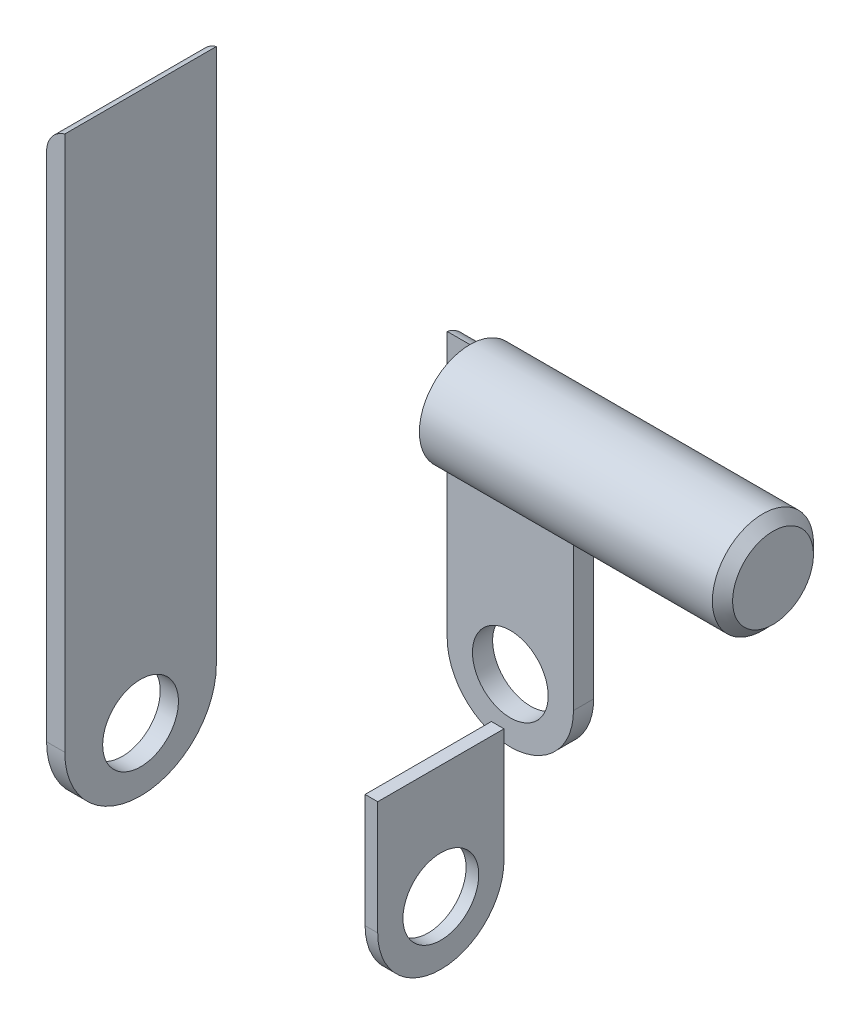
ISO-10303-21;
HEADER;
FILE_DESCRIPTION(('STEP AP214'),'2;1');
FILE_NAME('part.step','',(''),(''),'','','');
FILE_SCHEMA(('AUTOMOTIVE_DESIGN { 1 0 10303 214 1 1 1 1 }'));
ENDSEC;
DATA;
#1=APPLICATION_CONTEXT('core data for automotive mechanical design processes');
#2=APPLICATION_PROTOCOL_DEFINITION('international standard','automotive_design',2000,#1);
#3=PRODUCT_CONTEXT('',#1,'mechanical');
#4=PRODUCT('Part','Part','',(#3));
#5=PRODUCT_RELATED_PRODUCT_CATEGORY('part','',(#4));
#6=PRODUCT_DEFINITION_FORMATION('','',#4);
#7=PRODUCT_DEFINITION_CONTEXT('part definition',#1,'design');
#8=PRODUCT_DEFINITION('design','',#6,#7);
#9=PRODUCT_DEFINITION_SHAPE('','',#8);
#10=(LENGTH_UNIT() NAMED_UNIT(*) SI_UNIT(.MILLI.,.METRE.));
#11=(NAMED_UNIT(*) PLANE_ANGLE_UNIT() SI_UNIT($,.RADIAN.));
#12=(NAMED_UNIT(*) SI_UNIT($,.STERADIAN.) SOLID_ANGLE_UNIT());
#13=UNCERTAINTY_MEASURE_WITH_UNIT(LENGTH_MEASURE(1.E-05),#10,'distance_accuracy_value','');
#14=(GEOMETRIC_REPRESENTATION_CONTEXT(3) GLOBAL_UNCERTAINTY_ASSIGNED_CONTEXT((#13)) GLOBAL_UNIT_ASSIGNED_CONTEXT((#10,
#11,#12)) REPRESENTATION_CONTEXT('',''));
#15=CARTESIAN_POINT('',(0.,0.,0.));
#16=DIRECTION('',(0.,0.,1.));
#17=DIRECTION('',(1.,0.,0.));
#18=AXIS2_PLACEMENT_3D('',#15,#16,#17);
#19=CARTESIAN_POINT('',(-7.825,-7.625,1.25));
#20=DIRECTION('',(-1.,0.,0.));
#21=DIRECTION('',(0.,0.,1.));
#22=AXIS2_PLACEMENT_3D('',#19,#20,#21);
#23=PLANE('',#22);
#24=CARTESIAN_POINT('',(-7.825,-8.75,0.));
#25=DIRECTION('',(-1.,0.,0.));
#26=DIRECTION('',(0.,0.,1.));
#27=AXIS2_PLACEMENT_3D('',#24,#25,#26);
#28=CIRCLE('',#27,0.75);
#29=CARTESIAN_POINT('',(-7.825,-8.75,0.75));
#30=VERTEX_POINT('',#29);
#31=EDGE_CURVE('P0_E19',#30,#30,#28,.F.);
#32=ORIENTED_EDGE('',*,*,#31,.T.);
#33=EDGE_LOOP('',(#32));
#34=FACE_BOUND('',#33,.T.);
#35=CARTESIAN_POINT('',(-7.825,-8.75,0.));
#36=DIRECTION('',(-1.,0.,0.));
#37=DIRECTION('',(0.,0.,1.));
#38=AXIS2_PLACEMENT_3D('',#35,#36,#37);
#39=CIRCLE('',#38,1.25);
#40=CARTESIAN_POINT('',(-7.825,-8.75,1.25));
#41=VERTEX_POINT('',#40);
#42=CARTESIAN_POINT('',(-7.825,-8.75,-1.25));
#43=VERTEX_POINT('',#42);
#44=EDGE_CURVE('P0_E47',#41,#43,#39,.F.);
#45=ORIENTED_EDGE('',*,*,#44,.F.);
#46=DIRECTION('',(0.,1.,0.));
#47=VECTOR('',#46,1.);
#48=CARTESIAN_POINT('',(-7.825,-10.,1.25));
#49=LINE('',#48,#47);
#50=CARTESIAN_POINT('',(-7.825,-6.5,1.25));
#51=VERTEX_POINT('',#50);
#52=EDGE_CURVE('P0_E51',#41,#51,#49,.T.);
#53=ORIENTED_EDGE('',*,*,#52,.T.);
#54=DIRECTION('',(0.,0.,1.));
#55=VECTOR('',#54,1.);
#56=CARTESIAN_POINT('',(-7.825,-6.5,1.25));
#57=LINE('',#56,#55);
#58=CARTESIAN_POINT('',(-7.825,-6.5,-1.25));
#59=VERTEX_POINT('',#58);
#60=EDGE_CURVE('P0_E65',#59,#51,#57,.T.);
#61=ORIENTED_EDGE('',*,*,#60,.F.);
#62=DIRECTION('',(0.,1.,0.));
#63=VECTOR('',#62,1.);
#64=CARTESIAN_POINT('',(-7.825,-10.,-1.25));
#65=LINE('',#64,#63);
#66=EDGE_CURVE('P0_E64',#59,#43,#65,.F.);
#67=ORIENTED_EDGE('',*,*,#66,.T.);
#68=EDGE_LOOP('',(#45,#53,#61,#67));
#69=FACE_BOUND('',#68,.T.);
#70=ADVANCED_FACE('P0_F16',(#34,#69),#23,.T.);
#71=CARTESIAN_POINT('',(-7.825,-8.75,0.));
#72=DIRECTION('',(-1.,0.,0.));
#73=DIRECTION('',(0.,0.,1.));
#74=AXIS2_PLACEMENT_3D('',#71,#72,#73);
#75=CYLINDRICAL_SURFACE('',#74,0.75);
#76=ORIENTED_EDGE('',*,*,#31,.F.);
#77=EDGE_LOOP('',(#76));
#78=FACE_BOUND('',#77,.T.);
#79=CARTESIAN_POINT('',(-7.575,-8.75,0.));
#80=DIRECTION('',(-1.,0.,0.));
#81=DIRECTION('',(0.,0.,1.));
#82=AXIS2_PLACEMENT_3D('',#79,#80,#81);
#83=CIRCLE('',#82,0.75);
#84=CARTESIAN_POINT('',(-7.575,-8.75,0.75));
#85=VERTEX_POINT('',#84);
#86=EDGE_CURVE('P0_E75',#85,#85,#83,.T.);
#87=ORIENTED_EDGE('',*,*,#86,.F.);
#88=EDGE_LOOP('',(#87));
#89=FACE_BOUND('',#88,.T.);
#90=ADVANCED_FACE('P0_F114',(#78,#89),#75,.F.);
#91=CARTESIAN_POINT('',(-7.7,-6.5,1.25));
#92=DIRECTION('',(0.,1.,0.));
#93=DIRECTION('',(0.,0.,1.));
#94=AXIS2_PLACEMENT_3D('',#91,#92,#93);
#95=PLANE('',#94);
#96=ORIENTED_EDGE('',*,*,#60,.T.);
#97=DIRECTION('',(-1.,0.,0.));
#98=VECTOR('',#97,1.);
#99=CARTESIAN_POINT('',(-7.825,-6.5,1.25));
#100=LINE('',#99,#98);
#101=CARTESIAN_POINT('',(-7.575,-6.5,1.25));
#102=VERTEX_POINT('',#101);
#103=EDGE_CURVE('P0_E72',#51,#102,#100,.F.);
#104=ORIENTED_EDGE('',*,*,#103,.T.);
#105=DIRECTION('',(0.,0.,-1.));
#106=VECTOR('',#105,1.);
#107=CARTESIAN_POINT('',(-7.575,-6.5,1.25));
#108=LINE('',#107,#106);
#109=CARTESIAN_POINT('',(-7.575,-6.5,-1.25));
#110=VERTEX_POINT('',#109);
#111=EDGE_CURVE('P0_E61',#110,#102,#108,.F.);
#112=ORIENTED_EDGE('',*,*,#111,.F.);
#113=DIRECTION('',(1.,0.,0.));
#114=VECTOR('',#113,1.);
#115=CARTESIAN_POINT('',(-7.825,-6.5,-1.25));
#116=LINE('',#115,#114);
#117=EDGE_CURVE('P0_E67',#110,#59,#116,.F.);
#118=ORIENTED_EDGE('',*,*,#117,.T.);
#119=EDGE_LOOP('',(#96,#104,#112,#118));
#120=FACE_BOUND('',#119,.T.);
#121=ADVANCED_FACE('P0_F112',(#120),#95,.T.);
#122=CARTESIAN_POINT('',(-7.825,-10.,1.25));
#123=DIRECTION('',(0.,0.,-1.));
#124=DIRECTION('',(-1.,0.,0.));
#125=AXIS2_PLACEMENT_3D('',#122,#123,#124);
#126=PLANE('',#125);
#127=DIRECTION('',(0.,1.,0.));
#128=VECTOR('',#127,1.);
#129=CARTESIAN_POINT('',(-7.575,-7.625,1.25));
#130=LINE('',#129,#128);
#131=CARTESIAN_POINT('',(-7.575,-8.75,1.25));
#132=VERTEX_POINT('',#131);
#133=EDGE_CURVE('P0_E87',#102,#132,#130,.F.);
#134=ORIENTED_EDGE('',*,*,#133,.F.);
#135=ORIENTED_EDGE('',*,*,#103,.F.);
#136=ORIENTED_EDGE('',*,*,#52,.F.);
#137=DIRECTION('',(-1.,0.,0.));
#138=VECTOR('',#137,1.);
#139=CARTESIAN_POINT('',(-7.575,-8.75,1.25));
#140=LINE('',#139,#138);
#141=EDGE_CURVE('P0_E71',#132,#41,#140,.T.);
#142=ORIENTED_EDGE('',*,*,#141,.F.);
#143=EDGE_LOOP('',(#134,#135,#136,#142));
#144=FACE_BOUND('',#143,.T.);
#145=ADVANCED_FACE('P0_F111',(#144),#126,.F.);
#146=CARTESIAN_POINT('',(-7.575,-8.75,0.));
#147=DIRECTION('',(-1.,0.,0.));
#148=DIRECTION('',(0.,0.,1.));
#149=AXIS2_PLACEMENT_3D('',#146,#147,#148);
#150=CYLINDRICAL_SURFACE('',#149,1.25);
#151=CARTESIAN_POINT('',(-7.575,-8.75,0.));
#152=DIRECTION('',(-1.,0.,0.));
#153=DIRECTION('',(0.,0.,1.));
#154=AXIS2_PLACEMENT_3D('',#151,#152,#153);
#155=CIRCLE('',#154,1.25);
#156=CARTESIAN_POINT('',(-7.575,-8.75,-1.25));
#157=VERTEX_POINT('',#156);
#158=EDGE_CURVE('P0_E25',#132,#157,#155,.F.);
#159=ORIENTED_EDGE('',*,*,#158,.F.);
#160=ORIENTED_EDGE('',*,*,#141,.T.);
#161=ORIENTED_EDGE('',*,*,#44,.T.);
#162=DIRECTION('',(1.,0.,0.));
#163=VECTOR('',#162,1.);
#164=CARTESIAN_POINT('',(-7.825,-8.75,-1.25));
#165=LINE('',#164,#163);
#166=EDGE_CURVE('P0_E34',#43,#157,#165,.T.);
#167=ORIENTED_EDGE('',*,*,#166,.T.);
#168=EDGE_LOOP('',(#159,#160,#161,#167));
#169=FACE_BOUND('',#168,.T.);
#170=ADVANCED_FACE('P0_F70',(#169),#150,.T.);
#171=CARTESIAN_POINT('',(-7.825,-10.,-1.25));
#172=DIRECTION('',(0.,0.,1.));
#173=DIRECTION('',(1.,0.,0.));
#174=AXIS2_PLACEMENT_3D('',#171,#172,#173);
#175=PLANE('',#174);
#176=ORIENTED_EDGE('',*,*,#66,.F.);
#177=ORIENTED_EDGE('',*,*,#117,.F.);
#178=DIRECTION('',(0.,1.,0.));
#179=VECTOR('',#178,1.);
#180=CARTESIAN_POINT('',(-7.575,-7.625,-1.25));
#181=LINE('',#180,#179);
#182=EDGE_CURVE('P0_E11',#157,#110,#181,.T.);
#183=ORIENTED_EDGE('',*,*,#182,.F.);
#184=ORIENTED_EDGE('',*,*,#166,.F.);
#185=EDGE_LOOP('',(#176,#177,#183,#184));
#186=FACE_BOUND('',#185,.T.);
#187=ADVANCED_FACE('P0_F73',(#186),#175,.F.);
#188=CARTESIAN_POINT('',(-7.575,-7.625,1.25));
#189=DIRECTION('',(1.,0.,0.));
#190=DIRECTION('',(0.,0.,-1.));
#191=AXIS2_PLACEMENT_3D('',#188,#189,#190);
#192=PLANE('',#191);
#193=ORIENTED_EDGE('',*,*,#158,.T.);
#194=ORIENTED_EDGE('',*,*,#182,.T.);
#195=ORIENTED_EDGE('',*,*,#111,.T.);
#196=ORIENTED_EDGE('',*,*,#133,.T.);
#197=EDGE_LOOP('',(#193,#194,#195,#196));
#198=FACE_BOUND('',#197,.T.);
#199=ORIENTED_EDGE('',*,*,#86,.T.);
#200=EDGE_LOOP('',(#199));
#201=FACE_BOUND('',#200,.T.);
#202=ADVANCED_FACE('P0_F107',(#198,#201),#192,.T.);
#203=CLOSED_SHELL('',(#70,#90,#121,#145,#170,#187,#202));
#204=MANIFOLD_SOLID_BREP('P0_B1',#203);
#205=CARTESIAN_POINT('',(-1.,0.,0.));
#206=DIRECTION('',(1.,0.,0.));
#207=DIRECTION('',(0.,0.,-1.));
#208=AXIS2_PLACEMENT_3D('',#205,#206,#207);
#209=PLANE('',#208);
#210=CARTESIAN_POINT('',(-0.999999999976353,0.,0.));
#211=DIRECTION('',(-1.,0.,0.));
#212=DIRECTION('',(0.,0.,1.));
#213=AXIS2_PLACEMENT_3D('',#210,#211,#212);
#214=CIRCLE('',#213,0.799999999969714);
#215=CARTESIAN_POINT('',(-0.999999999976353,0.,0.799999999969714));
#216=VERTEX_POINT('',#215);
#217=EDGE_CURVE('P1_E17',#216,#216,#214,.T.);
#218=ORIENTED_EDGE('',*,*,#217,.F.);
#219=EDGE_LOOP('',(#218));
#220=FACE_BOUND('',#219,.T.);
#221=ADVANCED_FACE('P1_F14',(#220),#209,.T.);
#222=CARTESIAN_POINT('',(-7.,0.,0.));
#223=DIRECTION('',(1.,0.,0.));
#224=DIRECTION('',(0.,0.,-1.));
#225=AXIS2_PLACEMENT_3D('',#222,#223,#224);
#226=PLANE('',#225);
#227=CARTESIAN_POINT('',(-7.,0.,0.));
#228=DIRECTION('',(-1.,0.,0.));
#229=DIRECTION('',(0.,0.,1.));
#230=AXIS2_PLACEMENT_3D('',#227,#228,#229);
#231=CIRCLE('',#230,1.);
#232=CARTESIAN_POINT('',(-7.,0.,1.));
#233=VERTEX_POINT('',#232);
#234=EDGE_CURVE('P1_E21',#233,#233,#231,.F.);
#235=ORIENTED_EDGE('',*,*,#234,.F.);
#236=EDGE_LOOP('',(#235));
#237=FACE_BOUND('',#236,.T.);
#238=ADVANCED_FACE('P1_F34',(#237),#226,.F.);
#239=CARTESIAN_POINT('',(-1.19999999992615,0.,0.));
#240=DIRECTION('',(-1.,0.,0.));
#241=DIRECTION('',(0.,0.,1.));
#242=AXIS2_PLACEMENT_3D('',#239,#240,#241);
#243=CONICAL_SURFACE('',#242,0.99999999991951,0.785398163397448);
#244=CARTESIAN_POINT('',(-1.2,0.,0.));
#245=DIRECTION('',(-1.,0.,0.));
#246=DIRECTION('',(0.,0.,1.));
#247=AXIS2_PLACEMENT_3D('',#244,#245,#246);
#248=CIRCLE('',#247,1.);
#249=CARTESIAN_POINT('',(-1.2,0.,1.));
#250=VERTEX_POINT('',#249);
#251=EDGE_CURVE('P1_E10',#250,#250,#248,.T.);
#252=ORIENTED_EDGE('',*,*,#251,.F.);
#253=EDGE_LOOP('',(#252));
#254=FACE_BOUND('',#253,.T.);
#255=ORIENTED_EDGE('',*,*,#217,.T.);
#256=EDGE_LOOP('',(#255));
#257=FACE_BOUND('',#256,.T.);
#258=ADVANCED_FACE('P1_F31',(#254,#257),#243,.T.);
#259=CARTESIAN_POINT('',(-1.2,0.,0.));
#260=DIRECTION('',(-1.,0.,0.));
#261=DIRECTION('',(0.,0.,1.));
#262=AXIS2_PLACEMENT_3D('',#259,#260,#261);
#263=CYLINDRICAL_SURFACE('',#262,1.);
#264=ORIENTED_EDGE('',*,*,#234,.T.);
#265=EDGE_LOOP('',(#264));
#266=FACE_BOUND('',#265,.T.);
#267=ORIENTED_EDGE('',*,*,#251,.T.);
#268=EDGE_LOOP('',(#267));
#269=FACE_BOUND('',#268,.T.);
#270=ADVANCED_FACE('P1_F40',(#266,#269),#263,.T.);
#271=CLOSED_SHELL('',(#221,#238,#258,#270));
#272=MANIFOLD_SOLID_BREP('P1_B1',#271);
#273=CARTESIAN_POINT('',(-11.95,-6.36994897495,-4.9));
#274=DIRECTION('',(0.,0.,-1.));
#275=DIRECTION('',(-1.,0.,0.));
#276=AXIS2_PLACEMENT_3D('',#273,#274,#275);
#277=PLANE('',#276);
#278=CARTESIAN_POINT('',(-10.7,-8.75,-4.9));
#279=DIRECTION('',(0.,0.,1.));
#280=DIRECTION('',(1.,0.,0.));
#281=AXIS2_PLACEMENT_3D('',#278,#279,#280);
#282=CIRCLE('',#281,0.75);
#283=CARTESIAN_POINT('',(-9.95,-8.75,-4.9));
#284=VERTEX_POINT('',#283);
#285=EDGE_CURVE('P2_E73',#284,#284,#282,.T.);
#286=ORIENTED_EDGE('',*,*,#285,.T.);
#287=EDGE_LOOP('',(#286));
#288=FACE_BOUND('',#287,.T.);
#289=CARTESIAN_POINT('',(-10.7,-8.75,-4.9));
#290=DIRECTION('',(0.,0.,-1.));
#291=DIRECTION('',(-1.,0.,0.));
#292=AXIS2_PLACEMENT_3D('',#289,#290,#291);
#293=CIRCLE('',#292,1.25);
#294=CARTESIAN_POINT('',(-11.95,-8.75,-4.9));
#295=VERTEX_POINT('',#294);
#296=CARTESIAN_POINT('',(-9.45,-8.75,-4.9));
#297=VERTEX_POINT('',#296);
#298=EDGE_CURVE('P2_E69',#295,#297,#293,.F.);
#299=ORIENTED_EDGE('',*,*,#298,.F.);
#300=DIRECTION('',(0.,1.,0.));
#301=VECTOR('',#300,1.);
#302=CARTESIAN_POINT('',(-11.95,-10.,-4.9));
#303=LINE('',#302,#301);
#304=CARTESIAN_POINT('',(-11.95,-3.98989794945,-4.9));
#305=VERTEX_POINT('',#304);
#306=EDGE_CURVE('P2_E59',#295,#305,#303,.T.);
#307=ORIENTED_EDGE('',*,*,#306,.T.);
#308=DIRECTION('',(-1.,0.,0.));
#309=VECTOR('',#308,1.);
#310=CARTESIAN_POINT('',(-11.95,-3.9898979499,-4.9));
#311=LINE('',#310,#309);
#312=CARTESIAN_POINT('',(-9.45,-3.98989794945,-4.9));
#313=VERTEX_POINT('',#312);
#314=EDGE_CURVE('P2_E19',#313,#305,#311,.T.);
#315=ORIENTED_EDGE('',*,*,#314,.F.);
#316=DIRECTION('',(0.,1.,0.));
#317=VECTOR('',#316,1.);
#318=CARTESIAN_POINT('',(-9.45,-10.,-4.9));
#319=LINE('',#318,#317);
#320=EDGE_CURVE('P2_E58',#313,#297,#319,.F.);
#321=ORIENTED_EDGE('',*,*,#320,.T.);
#322=EDGE_LOOP('',(#299,#307,#315,#321));
#323=FACE_BOUND('',#322,.T.);
#324=ADVANCED_FACE('P2_F16',(#288,#323),#277,.T.);
#325=CARTESIAN_POINT('',(-11.95,-3.989897949,-4.4));
#326=DIRECTION('',(1.,0.,0.));
#327=DIRECTION('',(0.,0.,-1.));
#328=AXIS2_PLACEMENT_3D('',#325,#326,#327);
#329=CYLINDRICAL_SURFACE('',#328,0.5);
#330=DIRECTION('',(1.,0.,0.));
#331=VECTOR('',#330,1.);
#332=CARTESIAN_POINT('',(-11.95,-3.500000000294,-4.5));
#333=LINE('',#332,#331);
#334=CARTESIAN_POINT('',(-9.45,-3.50000000036868,-4.5));
#335=VERTEX_POINT('',#334);
#336=CARTESIAN_POINT('',(-11.95,-3.50000000036868,-4.5));
#337=VERTEX_POINT('',#336);
#338=EDGE_CURVE('P2_E66',#335,#337,#333,.F.);
#339=ORIENTED_EDGE('',*,*,#338,.F.);
#340=CARTESIAN_POINT('',(-9.45,-3.989897949,-4.4));
#341=DIRECTION('',(1.,0.,0.));
#342=DIRECTION('',(0.,0.,-1.));
#343=AXIS2_PLACEMENT_3D('',#340,#341,#342);
#344=CIRCLE('',#343,0.5);
#345=EDGE_CURVE('P2_E63',#335,#313,#344,.F.);
#346=ORIENTED_EDGE('',*,*,#345,.T.);
#347=ORIENTED_EDGE('',*,*,#314,.T.);
#348=CARTESIAN_POINT('',(-11.95,-3.989897949,-4.4));
#349=DIRECTION('',(1.,0.,0.));
#350=DIRECTION('',(0.,0.,-1.));
#351=AXIS2_PLACEMENT_3D('',#348,#349,#350);
#352=CIRCLE('',#351,0.5);
#353=EDGE_CURVE('P2_E83',#305,#337,#352,.T.);
#354=ORIENTED_EDGE('',*,*,#353,.T.);
#355=EDGE_LOOP('',(#339,#346,#347,#354));
#356=FACE_BOUND('',#355,.T.);
#357=ADVANCED_FACE('P2_F64',(#356),#329,.T.);
#358=CARTESIAN_POINT('',(-11.95,-10.,-4.5));
#359=DIRECTION('',(1.,0.,0.));
#360=DIRECTION('',(0.,0.,-1.));
#361=AXIS2_PLACEMENT_3D('',#358,#359,#360);
#362=PLANE('',#361);
#363=DIRECTION('',(0.,1.,0.));
#364=VECTOR('',#363,1.);
#365=CARTESIAN_POINT('',(-11.95,-6.125000000067,-4.5));
#366=LINE('',#365,#364);
#367=CARTESIAN_POINT('',(-11.95,-8.75,-4.5));
#368=VERTEX_POINT('',#367);
#369=EDGE_CURVE('P2_E76',#337,#368,#366,.F.);
#370=ORIENTED_EDGE('',*,*,#369,.F.);
#371=ORIENTED_EDGE('',*,*,#353,.F.);
#372=ORIENTED_EDGE('',*,*,#306,.F.);
#373=DIRECTION('',(0.,0.,-1.));
#374=VECTOR('',#373,1.);
#375=CARTESIAN_POINT('',(-11.95,-8.75,-4.5));
#376=LINE('',#375,#374);
#377=EDGE_CURVE('P2_E80',#368,#295,#376,.T.);
#378=ORIENTED_EDGE('',*,*,#377,.F.);
#379=EDGE_LOOP('',(#370,#371,#372,#378));
#380=FACE_BOUND('',#379,.T.);
#381=ADVANCED_FACE('P2_F93',(#380),#362,.F.);
#382=CARTESIAN_POINT('',(-10.7,-8.75,-4.5));
#383=DIRECTION('',(0.,0.,-1.));
#384=DIRECTION('',(-1.,0.,0.));
#385=AXIS2_PLACEMENT_3D('',#382,#383,#384);
#386=CYLINDRICAL_SURFACE('',#385,1.25);
#387=ORIENTED_EDGE('',*,*,#298,.T.);
#388=DIRECTION('',(0.,0.,1.));
#389=VECTOR('',#388,1.);
#390=CARTESIAN_POINT('',(-9.45,-8.75,-4.5));
#391=LINE('',#390,#389);
#392=CARTESIAN_POINT('',(-9.45,-8.75,-4.5));
#393=VERTEX_POINT('',#392);
#394=EDGE_CURVE('P2_E34',#297,#393,#391,.T.);
#395=ORIENTED_EDGE('',*,*,#394,.T.);
#396=CARTESIAN_POINT('',(-10.7,-8.75,-4.5));
#397=DIRECTION('',(0.,0.,-1.));
#398=DIRECTION('',(-1.,0.,0.));
#399=AXIS2_PLACEMENT_3D('',#396,#397,#398);
#400=CIRCLE('',#399,1.25);
#401=EDGE_CURVE('P2_E85',#368,#393,#400,.F.);
#402=ORIENTED_EDGE('',*,*,#401,.F.);
#403=ORIENTED_EDGE('',*,*,#377,.T.);
#404=EDGE_LOOP('',(#387,#395,#402,#403));
#405=FACE_BOUND('',#404,.T.);
#406=ADVANCED_FACE('P2_F96',(#405),#386,.T.);
#407=CARTESIAN_POINT('',(-9.45,-10.,-4.5));
#408=DIRECTION('',(-1.,0.,0.));
#409=DIRECTION('',(0.,0.,1.));
#410=AXIS2_PLACEMENT_3D('',#407,#408,#409);
#411=PLANE('',#410);
#412=ORIENTED_EDGE('',*,*,#320,.F.);
#413=ORIENTED_EDGE('',*,*,#345,.F.);
#414=DIRECTION('',(0.,1.,0.));
#415=VECTOR('',#414,1.);
#416=CARTESIAN_POINT('',(-9.45,-6.125000000067,-4.5));
#417=LINE('',#416,#415);
#418=EDGE_CURVE('P2_E25',#393,#335,#417,.T.);
#419=ORIENTED_EDGE('',*,*,#418,.F.);
#420=ORIENTED_EDGE('',*,*,#394,.F.);
#421=EDGE_LOOP('',(#412,#413,#419,#420));
#422=FACE_BOUND('',#421,.T.);
#423=ADVANCED_FACE('P2_F71',(#422),#411,.F.);
#424=CARTESIAN_POINT('',(-10.7,-8.75,-4.5));
#425=DIRECTION('',(0.,0.,1.));
#426=DIRECTION('',(1.,0.,0.));
#427=AXIS2_PLACEMENT_3D('',#424,#425,#426);
#428=CYLINDRICAL_SURFACE('',#427,0.75);
#429=CARTESIAN_POINT('',(-10.7,-8.75,-4.5));
#430=DIRECTION('',(0.,0.,1.));
#431=DIRECTION('',(1.,0.,0.));
#432=AXIS2_PLACEMENT_3D('',#429,#430,#431);
#433=CIRCLE('',#432,0.75);
#434=CARTESIAN_POINT('',(-9.95,-8.75,-4.5));
#435=VERTEX_POINT('',#434);
#436=EDGE_CURVE('P2_E11',#435,#435,#433,.F.);
#437=ORIENTED_EDGE('',*,*,#436,.F.);
#438=EDGE_LOOP('',(#437));
#439=FACE_BOUND('',#438,.T.);
#440=ORIENTED_EDGE('',*,*,#285,.F.);
#441=EDGE_LOOP('',(#440));
#442=FACE_BOUND('',#441,.T.);
#443=ADVANCED_FACE('P2_F104',(#439,#442),#428,.F.);
#444=CARTESIAN_POINT('',(-11.95,-6.125000000067,-4.5));
#445=DIRECTION('',(0.,0.,1.));
#446=DIRECTION('',(1.,0.,0.));
#447=AXIS2_PLACEMENT_3D('',#444,#445,#446);
#448=PLANE('',#447);
#449=ORIENTED_EDGE('',*,*,#436,.T.);
#450=EDGE_LOOP('',(#449));
#451=FACE_BOUND('',#450,.T.);
#452=ORIENTED_EDGE('',*,*,#401,.T.);
#453=ORIENTED_EDGE('',*,*,#418,.T.);
#454=ORIENTED_EDGE('',*,*,#338,.T.);
#455=ORIENTED_EDGE('',*,*,#369,.T.);
#456=EDGE_LOOP('',(#452,#453,#454,#455));
#457=FACE_BOUND('',#456,.T.);
#458=ADVANCED_FACE('P2_F95',(#451,#457),#448,.T.);
#459=CLOSED_SHELL('',(#324,#357,#381,#406,#423,#443,#458));
#460=MANIFOLD_SOLID_BREP('P2_B1',#459);
#461=CARTESIAN_POINT('',(-13.88,-10.,0.));
#462=DIRECTION('',(-1.,0.,0.));
#463=DIRECTION('',(0.,0.,1.));
#464=AXIS2_PLACEMENT_3D('',#461,#462,#463);
#465=PLANE('',#464);
#466=CARTESIAN_POINT('',(-13.88,-8.75,0.));
#467=DIRECTION('',(-1.,0.,0.));
#468=DIRECTION('',(0.,0.,1.));
#469=AXIS2_PLACEMENT_3D('',#466,#467,#468);
#470=CIRCLE('',#469,0.75);
#471=CARTESIAN_POINT('',(-13.88,-8.75,0.75));
#472=VERTEX_POINT('',#471);
#473=EDGE_CURVE('P3_E77',#472,#472,#470,.F.);
#474=ORIENTED_EDGE('',*,*,#473,.T.);
#475=EDGE_LOOP('',(#474));
#476=FACE_BOUND('',#475,.T.);
#477=DIRECTION('',(0.,1.,0.));
#478=VECTOR('',#477,1.);
#479=CARTESIAN_POINT('',(-13.88,-10.,-1.5));
#480=LINE('',#479,#478);
#481=CARTESIAN_POINT('',(-13.88,1.62,-1.5));
#482=VERTEX_POINT('',#481);
#483=CARTESIAN_POINT('',(-13.88,-8.5,-1.5));
#484=VERTEX_POINT('',#483);
#485=EDGE_CURVE('P3_E61',#482,#484,#480,.F.);
#486=ORIENTED_EDGE('',*,*,#485,.T.);
#487=CARTESIAN_POINT('',(-13.88,-8.5,0.));
#488=DIRECTION('',(-1.,0.,0.));
#489=DIRECTION('',(0.,0.,1.));
#490=AXIS2_PLACEMENT_3D('',#487,#488,#489);
#491=CIRCLE('',#490,1.5);
#492=CARTESIAN_POINT('',(-13.88,-8.5,1.5));
#493=VERTEX_POINT('',#492);
#494=EDGE_CURVE('P3_E85',#493,#484,#491,.F.);
#495=ORIENTED_EDGE('',*,*,#494,.F.);
#496=DIRECTION('',(0.,1.,0.));
#497=VECTOR('',#496,1.);
#498=CARTESIAN_POINT('',(-13.88,-10.,1.5));
#499=LINE('',#498,#497);
#500=CARTESIAN_POINT('',(-13.88,1.62,1.5));
#501=VERTEX_POINT('',#500);
#502=EDGE_CURVE('P3_E64',#493,#501,#499,.T.);
#503=ORIENTED_EDGE('',*,*,#502,.T.);
#504=DIRECTION('',(0.,0.,1.));
#505=VECTOR('',#504,1.);
#506=CARTESIAN_POINT('',(-13.88,1.62,-1.5));
#507=LINE('',#506,#505);
#508=EDGE_CURVE('P3_E65',#482,#501,#507,.T.);
#509=ORIENTED_EDGE('',*,*,#508,.F.);
#510=EDGE_LOOP('',(#486,#495,#503,#509));
#511=FACE_BOUND('',#510,.T.);
#512=ADVANCED_FACE('P3_F16',(#476,#511),#465,.T.);
#513=CARTESIAN_POINT('',(-13.88,-10.,-1.5));
#514=DIRECTION('',(0.,0.,1.));
#515=DIRECTION('',(1.,0.,0.));
#516=AXIS2_PLACEMENT_3D('',#513,#514,#515);
#517=PLANE('',#516);
#518=CARTESIAN_POINT('',(-13.38,1.62,-1.5));
#519=DIRECTION('',(0.,0.,1.));
#520=DIRECTION('',(1.,0.,0.));
#521=AXIS2_PLACEMENT_3D('',#518,#519,#520);
#522=CIRCLE('',#521,0.5);
#523=CARTESIAN_POINT('',(-13.52,2.1,-1.5));
#524=VERTEX_POINT('',#523);
#525=EDGE_CURVE('P3_E19',#524,#482,#522,.T.);
#526=ORIENTED_EDGE('',*,*,#525,.F.);
#527=DIRECTION('',(0.,1.,0.));
#528=VECTOR('',#527,1.);
#529=CARTESIAN_POINT('',(-13.52,-10.,-1.5));
#530=LINE('',#529,#528);
#531=CARTESIAN_POINT('',(-13.52,-8.5,-1.5));
#532=VERTEX_POINT('',#531);
#533=EDGE_CURVE('P3_E59',#532,#524,#530,.T.);
#534=ORIENTED_EDGE('',*,*,#533,.F.);
#535=DIRECTION('',(-1.,0.,0.));
#536=VECTOR('',#535,1.);
#537=CARTESIAN_POINT('',(-13.52,-8.5,-1.5));
#538=LINE('',#537,#536);
#539=EDGE_CURVE('P3_E83',#484,#532,#538,.F.);
#540=ORIENTED_EDGE('',*,*,#539,.F.);
#541=ORIENTED_EDGE('',*,*,#485,.F.);
#542=EDGE_LOOP('',(#526,#534,#540,#541));
#543=FACE_BOUND('',#542,.T.);
#544=ADVANCED_FACE('P3_F56',(#543),#517,.F.);
#545=CARTESIAN_POINT('',(-13.38,1.62,-1.5));
#546=DIRECTION('',(0.,0.,1.));
#547=DIRECTION('',(1.,0.,0.));
#548=AXIS2_PLACEMENT_3D('',#545,#546,#547);
#549=CYLINDRICAL_SURFACE('',#548,0.5);
#550=DIRECTION('',(0.,0.,-1.));
#551=VECTOR('',#550,1.);
#552=CARTESIAN_POINT('',(-13.52,2.1,0.));
#553=LINE('',#552,#551);
#554=CARTESIAN_POINT('',(-13.52,2.1,1.5));
#555=VERTEX_POINT('',#554);
#556=EDGE_CURVE('P3_E67',#524,#555,#553,.F.);
#557=ORIENTED_EDGE('',*,*,#556,.F.);
#558=ORIENTED_EDGE('',*,*,#525,.T.);
#559=ORIENTED_EDGE('',*,*,#508,.T.);
#560=CARTESIAN_POINT('',(-13.38,1.62,1.5));
#561=DIRECTION('',(0.,0.,1.));
#562=DIRECTION('',(1.,0.,0.));
#563=AXIS2_PLACEMENT_3D('',#560,#561,#562);
#564=CIRCLE('',#563,0.5);
#565=EDGE_CURVE('P3_E70',#501,#555,#564,.F.);
#566=ORIENTED_EDGE('',*,*,#565,.T.);
#567=EDGE_LOOP('',(#557,#558,#559,#566));
#568=FACE_BOUND('',#567,.T.);
#569=ADVANCED_FACE('P3_F68',(#568),#549,.T.);
#570=CARTESIAN_POINT('',(-13.88,-10.,1.5));
#571=DIRECTION('',(0.,0.,-1.));
#572=DIRECTION('',(-1.,0.,0.));
#573=AXIS2_PLACEMENT_3D('',#570,#571,#572);
#574=PLANE('',#573);
#575=ORIENTED_EDGE('',*,*,#565,.F.);
#576=ORIENTED_EDGE('',*,*,#502,.F.);
#577=DIRECTION('',(-1.,0.,0.));
#578=VECTOR('',#577,1.);
#579=CARTESIAN_POINT('',(-13.52,-8.5,1.5));
#580=LINE('',#579,#578);
#581=CARTESIAN_POINT('',(-13.52,-8.5,1.5));
#582=VERTEX_POINT('',#581);
#583=EDGE_CURVE('P3_E34',#582,#493,#580,.T.);
#584=ORIENTED_EDGE('',*,*,#583,.F.);
#585=DIRECTION('',(0.,1.,0.));
#586=VECTOR('',#585,1.);
#587=CARTESIAN_POINT('',(-13.52,-10.,1.5));
#588=LINE('',#587,#586);
#589=EDGE_CURVE('P3_E73',#555,#582,#588,.F.);
#590=ORIENTED_EDGE('',*,*,#589,.F.);
#591=EDGE_LOOP('',(#575,#576,#584,#590));
#592=FACE_BOUND('',#591,.T.);
#593=ADVANCED_FACE('P3_F96',(#592),#574,.F.);
#594=CARTESIAN_POINT('',(-13.52,-8.5,0.));
#595=DIRECTION('',(-1.,0.,0.));
#596=DIRECTION('',(0.,0.,1.));
#597=AXIS2_PLACEMENT_3D('',#594,#595,#596);
#598=CYLINDRICAL_SURFACE('',#597,1.5);
#599=CARTESIAN_POINT('',(-13.52,-8.5,0.));
#600=DIRECTION('',(-1.,0.,0.));
#601=DIRECTION('',(0.,0.,1.));
#602=AXIS2_PLACEMENT_3D('',#599,#600,#601);
#603=CIRCLE('',#602,1.5);
#604=EDGE_CURVE('P3_E25',#582,#532,#603,.F.);
#605=ORIENTED_EDGE('',*,*,#604,.F.);
#606=ORIENTED_EDGE('',*,*,#583,.T.);
#607=ORIENTED_EDGE('',*,*,#494,.T.);
#608=ORIENTED_EDGE('',*,*,#539,.T.);
#609=EDGE_LOOP('',(#605,#606,#607,#608));
#610=FACE_BOUND('',#609,.T.);
#611=ADVANCED_FACE('P3_F93',(#610),#598,.T.);
#612=CARTESIAN_POINT('',(-13.88,-8.75,0.));
#613=DIRECTION('',(-1.,0.,0.));
#614=DIRECTION('',(0.,0.,1.));
#615=AXIS2_PLACEMENT_3D('',#612,#613,#614);
#616=CYLINDRICAL_SURFACE('',#615,0.75);
#617=CARTESIAN_POINT('',(-13.52,-8.75,0.));
#618=DIRECTION('',(-1.,0.,0.));
#619=DIRECTION('',(0.,0.,1.));
#620=AXIS2_PLACEMENT_3D('',#617,#618,#619);
#621=CIRCLE('',#620,0.75);
#622=CARTESIAN_POINT('',(-13.52,-8.75,0.75));
#623=VERTEX_POINT('',#622);
#624=EDGE_CURVE('P3_E11',#623,#623,#621,.T.);
#625=ORIENTED_EDGE('',*,*,#624,.F.);
#626=EDGE_LOOP('',(#625));
#627=FACE_BOUND('',#626,.T.);
#628=ORIENTED_EDGE('',*,*,#473,.F.);
#629=EDGE_LOOP('',(#628));
#630=FACE_BOUND('',#629,.T.);
#631=ADVANCED_FACE('P3_F104',(#627,#630),#616,.F.);
#632=CARTESIAN_POINT('',(-13.52,-10.,0.));
#633=DIRECTION('',(1.,0.,0.));
#634=DIRECTION('',(0.,0.,-1.));
#635=AXIS2_PLACEMENT_3D('',#632,#633,#634);
#636=PLANE('',#635);
#637=ORIENTED_EDGE('',*,*,#624,.T.);
#638=EDGE_LOOP('',(#637));
#639=FACE_BOUND('',#638,.T.);
#640=ORIENTED_EDGE('',*,*,#589,.T.);
#641=ORIENTED_EDGE('',*,*,#604,.T.);
#642=ORIENTED_EDGE('',*,*,#533,.T.);
#643=ORIENTED_EDGE('',*,*,#556,.T.);
#644=EDGE_LOOP('',(#640,#641,#642,#643));
#645=FACE_BOUND('',#644,.T.);
#646=ADVANCED_FACE('P3_F76',(#639,#645),#636,.T.);
#647=CLOSED_SHELL('',(#512,#544,#569,#593,#611,#631,#646));
#648=MANIFOLD_SOLID_BREP('P3_B1',#647);
#649=ADVANCED_BREP_SHAPE_REPRESENTATION('',(#18,#204,#272,#460,#648),#14);
#650=SHAPE_DEFINITION_REPRESENTATION(#9,#649);
ENDSEC;
END-ISO-10303-21;
